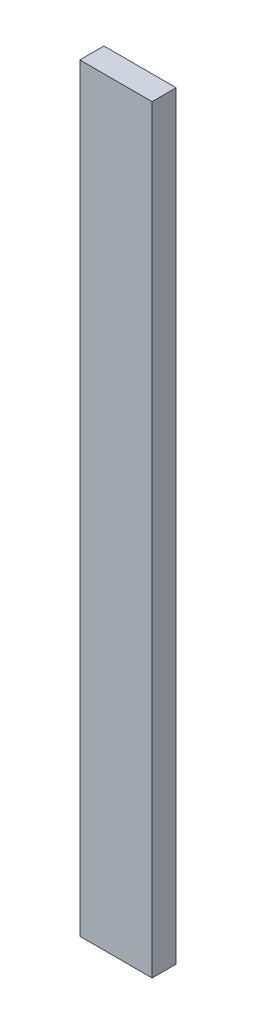
ISO-10303-21;
HEADER;
FILE_DESCRIPTION(('STEP AP214'),'2;1');
FILE_NAME('part.step','',(''),(''),'','','');
FILE_SCHEMA(('AUTOMOTIVE_DESIGN { 1 0 10303 214 1 1 1 1 }'));
ENDSEC;
DATA;
#1=APPLICATION_CONTEXT('core data for automotive mechanical design processes');
#2=APPLICATION_PROTOCOL_DEFINITION('international standard','automotive_design',2000,#1);
#3=PRODUCT_CONTEXT('',#1,'mechanical');
#4=PRODUCT('Part','Part','',(#3));
#5=PRODUCT_RELATED_PRODUCT_CATEGORY('part','',(#4));
#6=PRODUCT_DEFINITION_FORMATION('','',#4);
#7=PRODUCT_DEFINITION_CONTEXT('part definition',#1,'design');
#8=PRODUCT_DEFINITION('design','',#6,#7);
#9=PRODUCT_DEFINITION_SHAPE('','',#8);
#10=(LENGTH_UNIT() NAMED_UNIT(*) SI_UNIT(.MILLI.,.METRE.));
#11=(NAMED_UNIT(*) PLANE_ANGLE_UNIT() SI_UNIT($,.RADIAN.));
#12=(NAMED_UNIT(*) SI_UNIT($,.STERADIAN.) SOLID_ANGLE_UNIT());
#13=UNCERTAINTY_MEASURE_WITH_UNIT(LENGTH_MEASURE(1.E-05),#10,'distance_accuracy_value','');
#14=(GEOMETRIC_REPRESENTATION_CONTEXT(3) GLOBAL_UNCERTAINTY_ASSIGNED_CONTEXT((#13)) GLOBAL_UNIT_ASSIGNED_CONTEXT((#10,
#11,#12)) REPRESENTATION_CONTEXT('',''));
#15=CARTESIAN_POINT('',(0.,0.,0.));
#16=DIRECTION('',(0.,0.,1.));
#17=DIRECTION('',(1.,0.,0.));
#18=AXIS2_PLACEMENT_3D('',#15,#16,#17);
#19=CARTESIAN_POINT('',(0.,400.,0.));
#20=DIRECTION('',(1.,0.,0.));
#21=DIRECTION('',(0.,0.,-1.));
#22=AXIS2_PLACEMENT_3D('',#19,#20,#21);
#23=PLANE('',#22);
#24=DIRECTION('',(0.,0.,1.));
#25=VECTOR('',#24,1.);
#26=CARTESIAN_POINT('',(0.,0.,0.));
#27=LINE('',#26,#25);
#28=CARTESIAN_POINT('',(0.,0.,-12.7));
#29=VERTEX_POINT('',#28);
#30=CARTESIAN_POINT('',(0.,0.,0.));
#31=VERTEX_POINT('',#30);
#32=EDGE_CURVE('E107',#29,#31,#27,.T.);
#33=ORIENTED_EDGE('',*,*,#32,.T.);
#34=DIRECTION('',(0.,-1.,0.));
#35=VECTOR('',#34,1.);
#36=CARTESIAN_POINT('',(0.,400.,0.));
#37=LINE('',#36,#35);
#38=CARTESIAN_POINT('',(0.,400.,0.));
#39=VERTEX_POINT('',#38);
#40=EDGE_CURVE('E11',#39,#31,#37,.T.);
#41=ORIENTED_EDGE('',*,*,#40,.F.);
#42=DIRECTION('',(0.,0.,1.));
#43=VECTOR('',#42,1.);
#44=CARTESIAN_POINT('',(0.,400.,0.));
#45=LINE('',#44,#43);
#46=CARTESIAN_POINT('',(0.,400.,-12.7));
#47=VERTEX_POINT('',#46);
#48=EDGE_CURVE('E91',#47,#39,#45,.T.);
#49=ORIENTED_EDGE('',*,*,#48,.F.);
#50=DIRECTION('',(0.,-1.,0.));
#51=VECTOR('',#50,1.);
#52=CARTESIAN_POINT('',(0.,400.,-12.7));
#53=LINE('',#52,#51);
#54=EDGE_CURVE('E103',#47,#29,#53,.T.);
#55=ORIENTED_EDGE('',*,*,#54,.T.);
#56=EDGE_LOOP('',(#33,#41,#49,#55));
#57=FACE_BOUND('',#56,.T.);
#58=ADVANCED_FACE('F39',(#57),#23,.F.);
#59=CARTESIAN_POINT('',(0.,400.,0.));
#60=DIRECTION('',(0.,0.,-1.));
#61=DIRECTION('',(-1.,0.,0.));
#62=AXIS2_PLACEMENT_3D('',#59,#60,#61);
#63=PLANE('',#62);
#64=DIRECTION('',(1.,0.,0.));
#65=VECTOR('',#64,1.);
#66=CARTESIAN_POINT('',(0.,0.,0.));
#67=LINE('',#66,#65);
#68=CARTESIAN_POINT('',(38.1,0.,0.));
#69=VERTEX_POINT('',#68);
#70=EDGE_CURVE('E96',#31,#69,#67,.T.);
#71=ORIENTED_EDGE('',*,*,#70,.T.);
#72=DIRECTION('',(0.,-1.,0.));
#73=VECTOR('',#72,1.);
#74=CARTESIAN_POINT('',(38.1,400.,0.));
#75=LINE('',#74,#73);
#76=CARTESIAN_POINT('',(38.1,400.,0.));
#77=VERTEX_POINT('',#76);
#78=EDGE_CURVE('E48',#77,#69,#75,.T.);
#79=ORIENTED_EDGE('',*,*,#78,.F.);
#80=DIRECTION('',(1.,0.,0.));
#81=VECTOR('',#80,1.);
#82=CARTESIAN_POINT('',(0.,400.,0.));
#83=LINE('',#82,#81);
#84=EDGE_CURVE('E86',#39,#77,#83,.T.);
#85=ORIENTED_EDGE('',*,*,#84,.F.);
#86=ORIENTED_EDGE('',*,*,#40,.T.);
#87=EDGE_LOOP('',(#71,#79,#85,#86));
#88=FACE_BOUND('',#87,.T.);
#89=ADVANCED_FACE('F95',(#88),#63,.F.);
#90=CARTESIAN_POINT('',(38.1,400.,0.));
#91=DIRECTION('',(-1.,0.,0.));
#92=DIRECTION('',(0.,0.,1.));
#93=AXIS2_PLACEMENT_3D('',#90,#91,#92);
#94=PLANE('',#93);
#95=DIRECTION('',(0.,0.,-1.));
#96=VECTOR('',#95,1.);
#97=CARTESIAN_POINT('',(38.1,0.,0.));
#98=LINE('',#97,#96);
#99=CARTESIAN_POINT('',(38.1,0.,-12.7));
#100=VERTEX_POINT('',#99);
#101=EDGE_CURVE('E73',#69,#100,#98,.T.);
#102=ORIENTED_EDGE('',*,*,#101,.T.);
#103=DIRECTION('',(0.,-1.,0.));
#104=VECTOR('',#103,1.);
#105=CARTESIAN_POINT('',(38.1,400.,-12.7));
#106=LINE('',#105,#104);
#107=CARTESIAN_POINT('',(38.1,400.,-12.7));
#108=VERTEX_POINT('',#107);
#109=EDGE_CURVE('E98',#108,#100,#106,.T.);
#110=ORIENTED_EDGE('',*,*,#109,.F.);
#111=DIRECTION('',(0.,0.,-1.));
#112=VECTOR('',#111,1.);
#113=CARTESIAN_POINT('',(38.1,400.,0.));
#114=LINE('',#113,#112);
#115=EDGE_CURVE('E89',#77,#108,#114,.T.);
#116=ORIENTED_EDGE('',*,*,#115,.F.);
#117=ORIENTED_EDGE('',*,*,#78,.T.);
#118=EDGE_LOOP('',(#102,#110,#116,#117));
#119=FACE_BOUND('',#118,.T.);
#120=ADVANCED_FACE('F99',(#119),#94,.F.);
#121=CARTESIAN_POINT('',(0.,400.,-12.7));
#122=DIRECTION('',(0.,0.,1.));
#123=DIRECTION('',(1.,0.,0.));
#124=AXIS2_PLACEMENT_3D('',#121,#122,#123);
#125=PLANE('',#124);
#126=DIRECTION('',(-1.,0.,0.));
#127=VECTOR('',#126,1.);
#128=CARTESIAN_POINT('',(0.,0.,-12.7));
#129=LINE('',#128,#127);
#130=EDGE_CURVE('E79',#100,#29,#129,.T.);
#131=ORIENTED_EDGE('',*,*,#130,.T.);
#132=ORIENTED_EDGE('',*,*,#54,.F.);
#133=DIRECTION('',(-1.,0.,0.));
#134=VECTOR('',#133,1.);
#135=CARTESIAN_POINT('',(0.,400.,-12.7));
#136=LINE('',#135,#134);
#137=EDGE_CURVE('E56',#108,#47,#136,.T.);
#138=ORIENTED_EDGE('',*,*,#137,.F.);
#139=ORIENTED_EDGE('',*,*,#109,.T.);
#140=EDGE_LOOP('',(#131,#132,#138,#139));
#141=FACE_BOUND('',#140,.T.);
#142=ADVANCED_FACE('F120',(#141),#125,.F.);
#143=CARTESIAN_POINT('',(0.,400.,0.));
#144=DIRECTION('',(0.,-1.,0.));
#145=DIRECTION('',(0.,0.,-1.));
#146=AXIS2_PLACEMENT_3D('',#143,#144,#145);
#147=PLANE('',#146);
#148=ORIENTED_EDGE('',*,*,#48,.T.);
#149=ORIENTED_EDGE('',*,*,#84,.T.);
#150=ORIENTED_EDGE('',*,*,#115,.T.);
#151=ORIENTED_EDGE('',*,*,#137,.T.);
#152=EDGE_LOOP('',(#148,#149,#150,#151));
#153=FACE_BOUND('',#152,.T.);
#154=ADVANCED_FACE('F87',(#153),#147,.F.);
#155=CARTESIAN_POINT('',(0.,0.,0.));
#156=DIRECTION('',(0.,-1.,0.));
#157=DIRECTION('',(0.,0.,-1.));
#158=AXIS2_PLACEMENT_3D('',#155,#156,#157);
#159=PLANE('',#158);
#160=ORIENTED_EDGE('',*,*,#32,.F.);
#161=ORIENTED_EDGE('',*,*,#130,.F.);
#162=ORIENTED_EDGE('',*,*,#101,.F.);
#163=ORIENTED_EDGE('',*,*,#70,.F.);
#164=EDGE_LOOP('',(#160,#161,#162,#163));
#165=FACE_BOUND('',#164,.T.);
#166=ADVANCED_FACE('F123',(#165),#159,.T.);
#167=CLOSED_SHELL('',(#58,#89,#120,#142,#154,#166));
#168=MANIFOLD_SOLID_BREP('B2',#167);
#169=ADVANCED_BREP_SHAPE_REPRESENTATION('',(#18,#168),#14);
#170=SHAPE_DEFINITION_REPRESENTATION(#9,#169);
ENDSEC;
END-ISO-10303-21;
